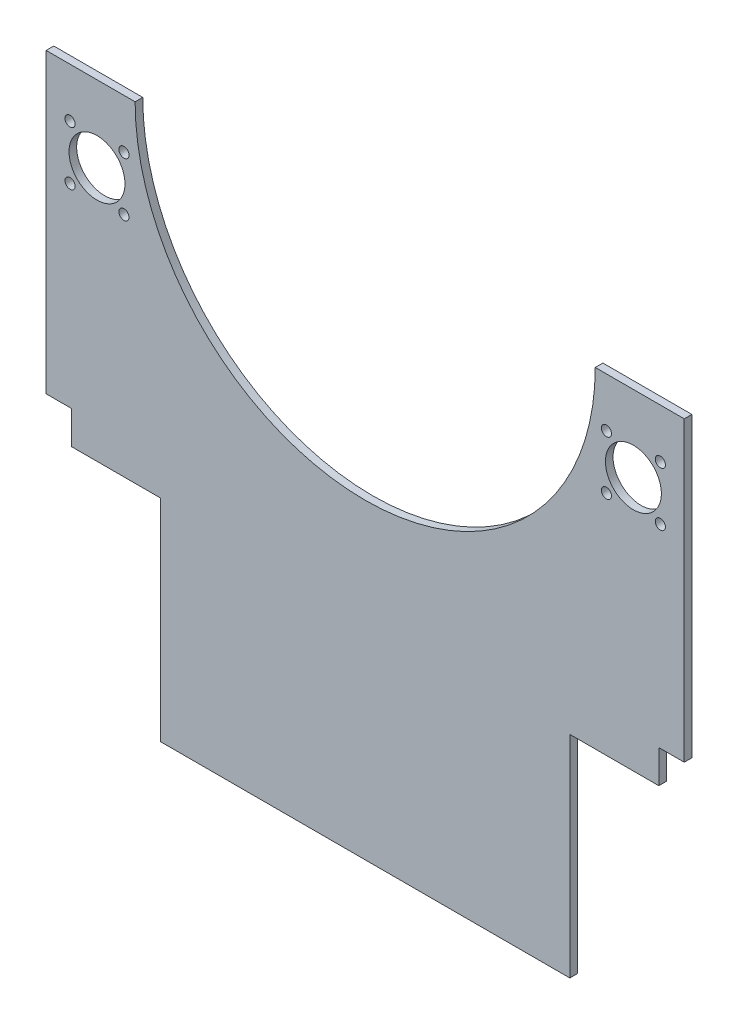
ISO-10303-21;
HEADER;
FILE_DESCRIPTION(('STEP AP214'),'2;1');
FILE_NAME('part.step','',(''),(''),'','','');
FILE_SCHEMA(('AUTOMOTIVE_DESIGN { 1 0 10303 214 1 1 1 1 }'));
ENDSEC;
DATA;
#1=APPLICATION_CONTEXT('core data for automotive mechanical design processes');
#2=APPLICATION_PROTOCOL_DEFINITION('international standard','automotive_design',2000,#1);
#3=PRODUCT_CONTEXT('',#1,'mechanical');
#4=PRODUCT('Part','Part','',(#3));
#5=PRODUCT_RELATED_PRODUCT_CATEGORY('part','',(#4));
#6=PRODUCT_DEFINITION_FORMATION('','',#4);
#7=PRODUCT_DEFINITION_CONTEXT('part definition',#1,'design');
#8=PRODUCT_DEFINITION('design','',#6,#7);
#9=PRODUCT_DEFINITION_SHAPE('','',#8);
#10=(LENGTH_UNIT() NAMED_UNIT(*) SI_UNIT(.MILLI.,.METRE.));
#11=(NAMED_UNIT(*) PLANE_ANGLE_UNIT() SI_UNIT($,.RADIAN.));
#12=(NAMED_UNIT(*) SI_UNIT($,.STERADIAN.) SOLID_ANGLE_UNIT());
#13=UNCERTAINTY_MEASURE_WITH_UNIT(LENGTH_MEASURE(1.E-05),#10,'distance_accuracy_value','');
#14=(GEOMETRIC_REPRESENTATION_CONTEXT(3) GLOBAL_UNCERTAINTY_ASSIGNED_CONTEXT((#13)) GLOBAL_UNIT_ASSIGNED_CONTEXT((#10,
#11,#12)) REPRESENTATION_CONTEXT('',''));
#15=CARTESIAN_POINT('',(0.,0.,0.));
#16=DIRECTION('',(0.,0.,1.));
#17=DIRECTION('',(1.,0.,0.));
#18=AXIS2_PLACEMENT_3D('',#15,#16,#17);
#19=CARTESIAN_POINT('',(0.,0.,3.));
#20=DIRECTION('',(0.,0.,1.));
#21=DIRECTION('',(1.,0.,0.));
#22=AXIS2_PLACEMENT_3D('',#19,#20,#21);
#23=PLANE('',#22);
#24=CARTESIAN_POINT('',(94.8933982822018,-19.3933982822018,3.));
#25=DIRECTION('',(0.,0.,1.));
#26=DIRECTION('',(1.,0.,0.));
#27=AXIS2_PLACEMENT_3D('',#24,#25,#26);
#28=CIRCLE('',#27,2.);
#29=CARTESIAN_POINT('',(96.8933982822018,-19.3933982822018,3.));
#30=VERTEX_POINT('',#29);
#31=EDGE_CURVE('E340',#30,#30,#28,.T.);
#32=ORIENTED_EDGE('',*,*,#31,.F.);
#33=EDGE_LOOP('',(#32));
#34=FACE_BOUND('',#33,.T.);
#35=CARTESIAN_POINT('',(-116.106601717798,-19.3933982822018,3.));
#36=DIRECTION('',(0.,0.,1.));
#37=DIRECTION('',(1.,0.,0.));
#38=AXIS2_PLACEMENT_3D('',#35,#36,#37);
#39=CIRCLE('',#38,2.);
#40=CARTESIAN_POINT('',(-114.106601717798,-19.3933982822018,3.));
#41=VERTEX_POINT('',#40);
#42=EDGE_CURVE('E352',#41,#41,#39,.T.);
#43=ORIENTED_EDGE('',*,*,#42,.F.);
#44=EDGE_LOOP('',(#43));
#45=FACE_BOUND('',#44,.T.);
#46=CARTESIAN_POINT('',(-94.8933982822018,-40.6066017177982,3.));
#47=DIRECTION('',(0.,0.,1.));
#48=DIRECTION('',(1.,0.,0.));
#49=AXIS2_PLACEMENT_3D('',#46,#47,#48);
#50=CIRCLE('',#49,2.);
#51=CARTESIAN_POINT('',(-92.8933982822018,-40.6066017177982,3.));
#52=VERTEX_POINT('',#51);
#53=EDGE_CURVE('E364',#52,#52,#50,.T.);
#54=ORIENTED_EDGE('',*,*,#53,.F.);
#55=EDGE_LOOP('',(#54));
#56=FACE_BOUND('',#55,.T.);
#57=CARTESIAN_POINT('',(-116.106601717798,-40.6066017177982,3.));
#58=DIRECTION('',(0.,0.,1.));
#59=DIRECTION('',(-1.,0.,0.));
#60=AXIS2_PLACEMENT_3D('',#57,#58,#59);
#61=CIRCLE('',#60,2.);
#62=CARTESIAN_POINT('',(-118.106601717798,-40.6066017177982,3.));
#63=VERTEX_POINT('',#62);
#64=EDGE_CURVE('E376',#63,#63,#61,.T.);
#65=ORIENTED_EDGE('',*,*,#64,.F.);
#66=EDGE_LOOP('',(#65));
#67=FACE_BOUND('',#66,.T.);
#68=CARTESIAN_POINT('',(-105.5,-30.,3.));
#69=DIRECTION('',(0.,0.,1.));
#70=DIRECTION('',(1.,0.,0.));
#71=AXIS2_PLACEMENT_3D('',#68,#69,#70);
#72=CIRCLE('',#71,11.);
#73=CARTESIAN_POINT('',(-94.5,-30.,3.));
#74=VERTEX_POINT('',#73);
#75=EDGE_CURVE('E168',#74,#74,#72,.T.);
#76=ORIENTED_EDGE('',*,*,#75,.F.);
#77=EDGE_LOOP('',(#76));
#78=FACE_BOUND('',#77,.T.);
#79=CARTESIAN_POINT('',(0.,0.,3.));
#80=DIRECTION('',(0.,0.,-1.));
#81=DIRECTION('',(1.,0.,0.));
#82=AXIS2_PLACEMENT_3D('',#79,#80,#81);
#83=CIRCLE('',#82,90.5);
#84=CARTESIAN_POINT('',(90.5,0.,3.));
#85=VERTEX_POINT('',#84);
#86=CARTESIAN_POINT('',(-90.5,0.,3.));
#87=VERTEX_POINT('',#86);
#88=EDGE_CURVE('E191',#85,#87,#83,.T.);
#89=ORIENTED_EDGE('',*,*,#88,.T.);
#90=DIRECTION('',(-1.,0.,0.));
#91=VECTOR('',#90,1.);
#92=CARTESIAN_POINT('',(-90.5,0.,3.));
#93=LINE('',#92,#91);
#94=CARTESIAN_POINT('',(-125.5,0.,3.));
#95=VERTEX_POINT('',#94);
#96=EDGE_CURVE('E109',#87,#95,#93,.T.);
#97=ORIENTED_EDGE('',*,*,#96,.T.);
#98=DIRECTION('',(0.,-1.,0.));
#99=VECTOR('',#98,1.);
#100=CARTESIAN_POINT('',(-125.5,0.,3.));
#101=LINE('',#100,#99);
#102=CARTESIAN_POINT('',(-125.5,-117.,3.));
#103=VERTEX_POINT('',#102);
#104=EDGE_CURVE('E224',#95,#103,#101,.T.);
#105=ORIENTED_EDGE('',*,*,#104,.T.);
#106=DIRECTION('',(1.,0.,0.));
#107=VECTOR('',#106,1.);
#108=CARTESIAN_POINT('',(-125.5,-117.,3.));
#109=LINE('',#108,#107);
#110=CARTESIAN_POINT('',(-115.5,-117.,3.));
#111=VERTEX_POINT('',#110);
#112=EDGE_CURVE('E243',#103,#111,#109,.T.);
#113=ORIENTED_EDGE('',*,*,#112,.T.);
#114=DIRECTION('',(0.,-1.,0.));
#115=VECTOR('',#114,1.);
#116=CARTESIAN_POINT('',(-115.5,-117.,3.));
#117=LINE('',#116,#115);
#118=CARTESIAN_POINT('',(-115.5,-130.,3.));
#119=VERTEX_POINT('',#118);
#120=EDGE_CURVE('E240',#111,#119,#117,.T.);
#121=ORIENTED_EDGE('',*,*,#120,.T.);
#122=DIRECTION('',(1.,0.,0.));
#123=VECTOR('',#122,1.);
#124=CARTESIAN_POINT('',(-115.5,-130.,3.));
#125=LINE('',#124,#123);
#126=CARTESIAN_POINT('',(-80.4999999999997,-130.,3.));
#127=VERTEX_POINT('',#126);
#128=EDGE_CURVE('E242',#119,#127,#125,.T.);
#129=ORIENTED_EDGE('',*,*,#128,.T.);
#130=DIRECTION('',(0.,-1.,0.));
#131=VECTOR('',#130,1.);
#132=CARTESIAN_POINT('',(-80.4999999999997,-130.,3.));
#133=LINE('',#132,#131);
#134=CARTESIAN_POINT('',(-80.4999999999997,-213.,3.));
#135=VERTEX_POINT('',#134);
#136=EDGE_CURVE('E245',#127,#135,#133,.T.);
#137=ORIENTED_EDGE('',*,*,#136,.T.);
#138=DIRECTION('',(1.,0.,0.));
#139=VECTOR('',#138,1.);
#140=CARTESIAN_POINT('',(-80.4999999999997,-213.,3.));
#141=LINE('',#140,#139);
#142=CARTESIAN_POINT('',(80.4999999999997,-213.,3.));
#143=VERTEX_POINT('',#142);
#144=EDGE_CURVE('E251',#135,#143,#141,.T.);
#145=ORIENTED_EDGE('',*,*,#144,.T.);
#146=DIRECTION('',(0.,1.,0.));
#147=VECTOR('',#146,1.);
#148=CARTESIAN_POINT('',(80.4999999999997,-130.,3.));
#149=LINE('',#148,#147);
#150=CARTESIAN_POINT('',(80.4999999999997,-130.,3.));
#151=VERTEX_POINT('',#150);
#152=EDGE_CURVE('E253',#143,#151,#149,.T.);
#153=ORIENTED_EDGE('',*,*,#152,.T.);
#154=DIRECTION('',(1.,0.,0.));
#155=VECTOR('',#154,1.);
#156=CARTESIAN_POINT('',(115.5,-130.,3.));
#157=LINE('',#156,#155);
#158=CARTESIAN_POINT('',(115.5,-130.,3.));
#159=VERTEX_POINT('',#158);
#160=EDGE_CURVE('E255',#151,#159,#157,.T.);
#161=ORIENTED_EDGE('',*,*,#160,.T.);
#162=DIRECTION('',(0.,1.,0.));
#163=VECTOR('',#162,1.);
#164=CARTESIAN_POINT('',(115.5,-117.,3.));
#165=LINE('',#164,#163);
#166=CARTESIAN_POINT('',(115.5,-117.,3.));
#167=VERTEX_POINT('',#166);
#168=EDGE_CURVE('E146',#159,#167,#165,.T.);
#169=ORIENTED_EDGE('',*,*,#168,.T.);
#170=DIRECTION('',(1.,0.,0.));
#171=VECTOR('',#170,1.);
#172=CARTESIAN_POINT('',(125.5,-117.,3.));
#173=LINE('',#172,#171);
#174=CARTESIAN_POINT('',(125.5,-117.,3.));
#175=VERTEX_POINT('',#174);
#176=EDGE_CURVE('E140',#167,#175,#173,.T.);
#177=ORIENTED_EDGE('',*,*,#176,.T.);
#178=DIRECTION('',(0.,1.,0.));
#179=VECTOR('',#178,1.);
#180=CARTESIAN_POINT('',(125.5,0.,3.));
#181=LINE('',#180,#179);
#182=CARTESIAN_POINT('',(125.5,0.,3.));
#183=VERTEX_POINT('',#182);
#184=EDGE_CURVE('E144',#175,#183,#181,.T.);
#185=ORIENTED_EDGE('',*,*,#184,.T.);
#186=DIRECTION('',(-1.,0.,0.));
#187=VECTOR('',#186,1.);
#188=CARTESIAN_POINT('',(90.5,0.,3.));
#189=LINE('',#188,#187);
#190=EDGE_CURVE('E48',#183,#85,#189,.T.);
#191=ORIENTED_EDGE('',*,*,#190,.T.);
#192=EDGE_LOOP('',(#89,#97,#105,#113,#121,#129,#137,#145,#153,#161,#169,#177,#185,#191));
#193=FACE_BOUND('',#192,.T.);
#194=CARTESIAN_POINT('',(-94.8933982822018,-19.3933982822018,3.));
#195=DIRECTION('',(0.,0.,1.));
#196=DIRECTION('',(-1.,0.,0.));
#197=AXIS2_PLACEMENT_3D('',#194,#195,#196);
#198=CIRCLE('',#197,2.);
#199=CARTESIAN_POINT('',(-96.8933982822018,-19.3933982822018,3.));
#200=VERTEX_POINT('',#199);
#201=EDGE_CURVE('E382',#200,#200,#198,.T.);
#202=ORIENTED_EDGE('',*,*,#201,.F.);
#203=EDGE_LOOP('',(#202));
#204=FACE_BOUND('',#203,.T.);
#205=CARTESIAN_POINT('',(116.106601717798,-19.3933982822018,3.));
#206=DIRECTION('',(0.,0.,1.));
#207=DIRECTION('',(-1.,0.,0.));
#208=AXIS2_PLACEMENT_3D('',#205,#206,#207);
#209=CIRCLE('',#208,2.);
#210=CARTESIAN_POINT('',(114.106601717798,-19.3933982822018,3.));
#211=VERTEX_POINT('',#210);
#212=EDGE_CURVE('E370',#211,#211,#209,.T.);
#213=ORIENTED_EDGE('',*,*,#212,.F.);
#214=EDGE_LOOP('',(#213));
#215=FACE_BOUND('',#214,.T.);
#216=CARTESIAN_POINT('',(94.8933982822018,-40.6066017177982,3.));
#217=DIRECTION('',(0.,0.,1.));
#218=DIRECTION('',(-1.,0.,0.));
#219=AXIS2_PLACEMENT_3D('',#216,#217,#218);
#220=CIRCLE('',#219,2.);
#221=CARTESIAN_POINT('',(92.8933982822018,-40.6066017177982,3.));
#222=VERTEX_POINT('',#221);
#223=EDGE_CURVE('E358',#222,#222,#220,.T.);
#224=ORIENTED_EDGE('',*,*,#223,.F.);
#225=EDGE_LOOP('',(#224));
#226=FACE_BOUND('',#225,.T.);
#227=CARTESIAN_POINT('',(116.106601717798,-40.6066017177982,3.));
#228=DIRECTION('',(0.,0.,1.));
#229=DIRECTION('',(1.,0.,0.));
#230=AXIS2_PLACEMENT_3D('',#227,#228,#229);
#231=CIRCLE('',#230,2.);
#232=CARTESIAN_POINT('',(118.106601717798,-40.6066017177982,3.));
#233=VERTEX_POINT('',#232);
#234=EDGE_CURVE('E346',#233,#233,#231,.T.);
#235=ORIENTED_EDGE('',*,*,#234,.F.);
#236=EDGE_LOOP('',(#235));
#237=FACE_BOUND('',#236,.T.);
#238=CARTESIAN_POINT('',(105.5,-30.,3.));
#239=DIRECTION('',(0.,0.,1.));
#240=DIRECTION('',(-1.,0.,0.));
#241=AXIS2_PLACEMENT_3D('',#238,#239,#240);
#242=CIRCLE('',#241,11.);
#243=CARTESIAN_POINT('',(94.5,-30.,3.));
#244=VERTEX_POINT('',#243);
#245=EDGE_CURVE('E331',#244,#244,#242,.T.);
#246=ORIENTED_EDGE('',*,*,#245,.F.);
#247=EDGE_LOOP('',(#246));
#248=FACE_BOUND('',#247,.T.);
#249=ADVANCED_FACE('F31',(#34,#45,#56,#67,#78,#193,#204,#215,#226,#237,#248),#23,.T.);
#250=CARTESIAN_POINT('',(0.,0.,0.));
#251=DIRECTION('',(0.,0.,1.));
#252=DIRECTION('',(1.,0.,0.));
#253=AXIS2_PLACEMENT_3D('',#250,#251,#252);
#254=PLANE('',#253);
#255=CARTESIAN_POINT('',(94.8933982822018,-19.3933982822018,0.));
#256=DIRECTION('',(0.,0.,1.));
#257=DIRECTION('',(1.,0.,0.));
#258=AXIS2_PLACEMENT_3D('',#255,#256,#257);
#259=CIRCLE('',#258,2.);
#260=CARTESIAN_POINT('',(96.8933982822018,-19.3933982822018,0.));
#261=VERTEX_POINT('',#260);
#262=EDGE_CURVE('E337',#261,#261,#259,.T.);
#263=ORIENTED_EDGE('',*,*,#262,.T.);
#264=EDGE_LOOP('',(#263));
#265=FACE_BOUND('',#264,.T.);
#266=CARTESIAN_POINT('',(-116.106601717798,-19.3933982822018,0.));
#267=DIRECTION('',(0.,0.,1.));
#268=DIRECTION('',(1.,0.,0.));
#269=AXIS2_PLACEMENT_3D('',#266,#267,#268);
#270=CIRCLE('',#269,2.);
#271=CARTESIAN_POINT('',(-114.106601717798,-19.3933982822018,0.));
#272=VERTEX_POINT('',#271);
#273=EDGE_CURVE('E349',#272,#272,#270,.T.);
#274=ORIENTED_EDGE('',*,*,#273,.T.);
#275=EDGE_LOOP('',(#274));
#276=FACE_BOUND('',#275,.T.);
#277=CARTESIAN_POINT('',(-94.8933982822018,-40.6066017177982,0.));
#278=DIRECTION('',(0.,0.,1.));
#279=DIRECTION('',(1.,0.,0.));
#280=AXIS2_PLACEMENT_3D('',#277,#278,#279);
#281=CIRCLE('',#280,2.);
#282=CARTESIAN_POINT('',(-92.8933982822018,-40.6066017177982,0.));
#283=VERTEX_POINT('',#282);
#284=EDGE_CURVE('E361',#283,#283,#281,.T.);
#285=ORIENTED_EDGE('',*,*,#284,.T.);
#286=EDGE_LOOP('',(#285));
#287=FACE_BOUND('',#286,.T.);
#288=CARTESIAN_POINT('',(-116.106601717798,-40.6066017177982,0.));
#289=DIRECTION('',(0.,0.,1.));
#290=DIRECTION('',(-1.,0.,0.));
#291=AXIS2_PLACEMENT_3D('',#288,#289,#290);
#292=CIRCLE('',#291,2.);
#293=CARTESIAN_POINT('',(-118.106601717798,-40.6066017177982,0.));
#294=VERTEX_POINT('',#293);
#295=EDGE_CURVE('E373',#294,#294,#292,.T.);
#296=ORIENTED_EDGE('',*,*,#295,.T.);
#297=EDGE_LOOP('',(#296));
#298=FACE_BOUND('',#297,.T.);
#299=CARTESIAN_POINT('',(-105.5,-30.,0.));
#300=DIRECTION('',(0.,0.,1.));
#301=DIRECTION('',(1.,0.,0.));
#302=AXIS2_PLACEMENT_3D('',#299,#300,#301);
#303=CIRCLE('',#302,11.);
#304=CARTESIAN_POINT('',(-94.5,-30.,0.));
#305=VERTEX_POINT('',#304);
#306=EDGE_CURVE('E385',#305,#305,#303,.T.);
#307=ORIENTED_EDGE('',*,*,#306,.T.);
#308=EDGE_LOOP('',(#307));
#309=FACE_BOUND('',#308,.T.);
#310=CARTESIAN_POINT('',(0.,0.,0.));
#311=DIRECTION('',(0.,0.,-1.));
#312=DIRECTION('',(1.,0.,0.));
#313=AXIS2_PLACEMENT_3D('',#310,#311,#312);
#314=CIRCLE('',#313,90.5);
#315=CARTESIAN_POINT('',(90.5,0.,0.));
#316=VERTEX_POINT('',#315);
#317=CARTESIAN_POINT('',(-90.5,0.,0.));
#318=VERTEX_POINT('',#317);
#319=EDGE_CURVE('E164',#316,#318,#314,.T.);
#320=ORIENTED_EDGE('',*,*,#319,.F.);
#321=DIRECTION('',(-1.,0.,0.));
#322=VECTOR('',#321,1.);
#323=CARTESIAN_POINT('',(90.5,0.,0.));
#324=LINE('',#323,#322);
#325=CARTESIAN_POINT('',(125.5,0.,0.));
#326=VERTEX_POINT('',#325);
#327=EDGE_CURVE('E101',#326,#316,#324,.T.);
#328=ORIENTED_EDGE('',*,*,#327,.F.);
#329=DIRECTION('',(0.,1.,0.));
#330=VECTOR('',#329,1.);
#331=CARTESIAN_POINT('',(125.5,0.,0.));
#332=LINE('',#331,#330);
#333=CARTESIAN_POINT('',(125.5,-117.,0.));
#334=VERTEX_POINT('',#333);
#335=EDGE_CURVE('E95',#334,#326,#332,.T.);
#336=ORIENTED_EDGE('',*,*,#335,.F.);
#337=DIRECTION('',(1.,0.,0.));
#338=VECTOR('',#337,1.);
#339=CARTESIAN_POINT('',(125.5,-117.,0.));
#340=LINE('',#339,#338);
#341=CARTESIAN_POINT('',(115.5,-117.,0.));
#342=VERTEX_POINT('',#341);
#343=EDGE_CURVE('E154',#342,#334,#340,.T.);
#344=ORIENTED_EDGE('',*,*,#343,.F.);
#345=DIRECTION('',(0.,1.,0.));
#346=VECTOR('',#345,1.);
#347=CARTESIAN_POINT('',(115.5,-117.,0.));
#348=LINE('',#347,#346);
#349=CARTESIAN_POINT('',(115.5,-130.,0.));
#350=VERTEX_POINT('',#349);
#351=EDGE_CURVE('E186',#350,#342,#348,.T.);
#352=ORIENTED_EDGE('',*,*,#351,.F.);
#353=DIRECTION('',(1.,0.,0.));
#354=VECTOR('',#353,1.);
#355=CARTESIAN_POINT('',(115.5,-130.,0.));
#356=LINE('',#355,#354);
#357=CARTESIAN_POINT('',(80.4999999999997,-130.,0.));
#358=VERTEX_POINT('',#357);
#359=EDGE_CURVE('E184',#358,#350,#356,.T.);
#360=ORIENTED_EDGE('',*,*,#359,.F.);
#361=DIRECTION('',(0.,1.,0.));
#362=VECTOR('',#361,1.);
#363=CARTESIAN_POINT('',(80.4999999999997,-130.,0.));
#364=LINE('',#363,#362);
#365=CARTESIAN_POINT('',(80.4999999999997,-213.,0.));
#366=VERTEX_POINT('',#365);
#367=EDGE_CURVE('E182',#366,#358,#364,.T.);
#368=ORIENTED_EDGE('',*,*,#367,.F.);
#369=DIRECTION('',(1.,0.,0.));
#370=VECTOR('',#369,1.);
#371=CARTESIAN_POINT('',(-80.4999999999997,-213.,0.));
#372=LINE('',#371,#370);
#373=CARTESIAN_POINT('',(-80.4999999999997,-213.,0.));
#374=VERTEX_POINT('',#373);
#375=EDGE_CURVE('E180',#374,#366,#372,.T.);
#376=ORIENTED_EDGE('',*,*,#375,.F.);
#377=DIRECTION('',(0.,-1.,0.));
#378=VECTOR('',#377,1.);
#379=CARTESIAN_POINT('',(-80.4999999999997,-130.,0.));
#380=LINE('',#379,#378);
#381=CARTESIAN_POINT('',(-80.4999999999997,-130.,0.));
#382=VERTEX_POINT('',#381);
#383=EDGE_CURVE('E178',#382,#374,#380,.T.);
#384=ORIENTED_EDGE('',*,*,#383,.F.);
#385=DIRECTION('',(1.,0.,0.));
#386=VECTOR('',#385,1.);
#387=CARTESIAN_POINT('',(-115.5,-130.,0.));
#388=LINE('',#387,#386);
#389=CARTESIAN_POINT('',(-115.5,-130.,0.));
#390=VERTEX_POINT('',#389);
#391=EDGE_CURVE('E176',#390,#382,#388,.T.);
#392=ORIENTED_EDGE('',*,*,#391,.F.);
#393=DIRECTION('',(0.,-1.,0.));
#394=VECTOR('',#393,1.);
#395=CARTESIAN_POINT('',(-115.5,-117.,0.));
#396=LINE('',#395,#394);
#397=CARTESIAN_POINT('',(-115.5,-117.,0.));
#398=VERTEX_POINT('',#397);
#399=EDGE_CURVE('E174',#398,#390,#396,.T.);
#400=ORIENTED_EDGE('',*,*,#399,.F.);
#401=DIRECTION('',(1.,0.,0.));
#402=VECTOR('',#401,1.);
#403=CARTESIAN_POINT('',(-125.5,-117.,0.));
#404=LINE('',#403,#402);
#405=CARTESIAN_POINT('',(-125.5,-117.,0.));
#406=VERTEX_POINT('',#405);
#407=EDGE_CURVE('E172',#406,#398,#404,.T.);
#408=ORIENTED_EDGE('',*,*,#407,.F.);
#409=DIRECTION('',(0.,-1.,0.));
#410=VECTOR('',#409,1.);
#411=CARTESIAN_POINT('',(-125.5,0.,0.));
#412=LINE('',#411,#410);
#413=CARTESIAN_POINT('',(-125.5,0.,0.));
#414=VERTEX_POINT('',#413);
#415=EDGE_CURVE('E170',#414,#406,#412,.T.);
#416=ORIENTED_EDGE('',*,*,#415,.F.);
#417=DIRECTION('',(-1.,0.,0.));
#418=VECTOR('',#417,1.);
#419=CARTESIAN_POINT('',(-90.5,0.,0.));
#420=LINE('',#419,#418);
#421=EDGE_CURVE('E167',#318,#414,#420,.T.);
#422=ORIENTED_EDGE('',*,*,#421,.F.);
#423=EDGE_LOOP('',(#320,#328,#336,#344,#352,#360,#368,#376,#384,#392,#400,#408,#416,#422));
#424=FACE_BOUND('',#423,.T.);
#425=CARTESIAN_POINT('',(-94.8933982822018,-19.3933982822018,0.));
#426=DIRECTION('',(0.,0.,1.));
#427=DIRECTION('',(-1.,0.,0.));
#428=AXIS2_PLACEMENT_3D('',#425,#426,#427);
#429=CIRCLE('',#428,2.);
#430=CARTESIAN_POINT('',(-96.8933982822018,-19.3933982822018,0.));
#431=VERTEX_POINT('',#430);
#432=EDGE_CURVE('E379',#431,#431,#429,.T.);
#433=ORIENTED_EDGE('',*,*,#432,.T.);
#434=EDGE_LOOP('',(#433));
#435=FACE_BOUND('',#434,.T.);
#436=CARTESIAN_POINT('',(116.106601717798,-19.3933982822018,0.));
#437=DIRECTION('',(0.,0.,1.));
#438=DIRECTION('',(-1.,0.,0.));
#439=AXIS2_PLACEMENT_3D('',#436,#437,#438);
#440=CIRCLE('',#439,2.);
#441=CARTESIAN_POINT('',(114.106601717798,-19.3933982822018,0.));
#442=VERTEX_POINT('',#441);
#443=EDGE_CURVE('E367',#442,#442,#440,.T.);
#444=ORIENTED_EDGE('',*,*,#443,.T.);
#445=EDGE_LOOP('',(#444));
#446=FACE_BOUND('',#445,.T.);
#447=CARTESIAN_POINT('',(94.8933982822018,-40.6066017177982,0.));
#448=DIRECTION('',(0.,0.,1.));
#449=DIRECTION('',(-1.,0.,0.));
#450=AXIS2_PLACEMENT_3D('',#447,#448,#449);
#451=CIRCLE('',#450,2.);
#452=CARTESIAN_POINT('',(92.8933982822018,-40.6066017177982,0.));
#453=VERTEX_POINT('',#452);
#454=EDGE_CURVE('E355',#453,#453,#451,.T.);
#455=ORIENTED_EDGE('',*,*,#454,.T.);
#456=EDGE_LOOP('',(#455));
#457=FACE_BOUND('',#456,.T.);
#458=CARTESIAN_POINT('',(116.106601717798,-40.6066017177982,0.));
#459=DIRECTION('',(0.,0.,1.));
#460=DIRECTION('',(1.,0.,0.));
#461=AXIS2_PLACEMENT_3D('',#458,#459,#460);
#462=CIRCLE('',#461,2.);
#463=CARTESIAN_POINT('',(118.106601717798,-40.6066017177982,0.));
#464=VERTEX_POINT('',#463);
#465=EDGE_CURVE('E343',#464,#464,#462,.T.);
#466=ORIENTED_EDGE('',*,*,#465,.T.);
#467=EDGE_LOOP('',(#466));
#468=FACE_BOUND('',#467,.T.);
#469=CARTESIAN_POINT('',(105.5,-30.,0.));
#470=DIRECTION('',(0.,0.,1.));
#471=DIRECTION('',(-1.,0.,0.));
#472=AXIS2_PLACEMENT_3D('',#469,#470,#471);
#473=CIRCLE('',#472,11.);
#474=CARTESIAN_POINT('',(94.5,-30.,0.));
#475=VERTEX_POINT('',#474);
#476=EDGE_CURVE('E334',#475,#475,#473,.T.);
#477=ORIENTED_EDGE('',*,*,#476,.T.);
#478=EDGE_LOOP('',(#477));
#479=FACE_BOUND('',#478,.T.);
#480=ADVANCED_FACE('F228',(#265,#276,#287,#298,#309,#424,#435,#446,#457,#468,#479),#254,.F.);
#481=CARTESIAN_POINT('',(0.,0.,3.));
#482=DIRECTION('',(0.,0.,-1.));
#483=DIRECTION('',(-1.,0.,0.));
#484=AXIS2_PLACEMENT_3D('',#481,#482,#483);
#485=CYLINDRICAL_SURFACE('',#484,90.5);
#486=ORIENTED_EDGE('',*,*,#319,.T.);
#487=DIRECTION('',(0.,0.,-1.));
#488=VECTOR('',#487,1.);
#489=CARTESIAN_POINT('',(-90.5,0.,3.));
#490=LINE('',#489,#488);
#491=EDGE_CURVE('E11',#87,#318,#490,.T.);
#492=ORIENTED_EDGE('',*,*,#491,.F.);
#493=ORIENTED_EDGE('',*,*,#88,.F.);
#494=DIRECTION('',(0.,0.,-1.));
#495=VECTOR('',#494,1.);
#496=CARTESIAN_POINT('',(90.5,0.,3.));
#497=LINE('',#496,#495);
#498=EDGE_CURVE('E160',#85,#316,#497,.T.);
#499=ORIENTED_EDGE('',*,*,#498,.T.);
#500=EDGE_LOOP('',(#486,#492,#493,#499));
#501=FACE_BOUND('',#500,.T.);
#502=ADVANCED_FACE('F33',(#501),#485,.F.);
#503=CARTESIAN_POINT('',(-90.5,0.,3.));
#504=DIRECTION('',(0.,-1.,0.));
#505=DIRECTION('',(1.,0.,0.));
#506=AXIS2_PLACEMENT_3D('',#503,#504,#505);
#507=PLANE('',#506);
#508=ORIENTED_EDGE('',*,*,#421,.T.);
#509=DIRECTION('',(0.,0.,-1.));
#510=VECTOR('',#509,1.);
#511=CARTESIAN_POINT('',(-125.5,0.,3.));
#512=LINE('',#511,#510);
#513=EDGE_CURVE('E40',#95,#414,#512,.T.);
#514=ORIENTED_EDGE('',*,*,#513,.F.);
#515=ORIENTED_EDGE('',*,*,#96,.F.);
#516=ORIENTED_EDGE('',*,*,#491,.T.);
#517=EDGE_LOOP('',(#508,#514,#515,#516));
#518=FACE_BOUND('',#517,.T.);
#519=ADVANCED_FACE('F568',(#518),#507,.F.);
#520=CARTESIAN_POINT('',(-125.5,0.,3.));
#521=DIRECTION('',(1.,0.,0.));
#522=DIRECTION('',(0.,0.,-1.));
#523=AXIS2_PLACEMENT_3D('',#520,#521,#522);
#524=PLANE('',#523);
#525=ORIENTED_EDGE('',*,*,#415,.T.);
#526=DIRECTION('',(0.,0.,-1.));
#527=VECTOR('',#526,1.);
#528=CARTESIAN_POINT('',(-125.5,-117.,3.));
#529=LINE('',#528,#527);
#530=EDGE_CURVE('E216',#103,#406,#529,.T.);
#531=ORIENTED_EDGE('',*,*,#530,.F.);
#532=ORIENTED_EDGE('',*,*,#104,.F.);
#533=ORIENTED_EDGE('',*,*,#513,.T.);
#534=EDGE_LOOP('',(#525,#531,#532,#533));
#535=FACE_BOUND('',#534,.T.);
#536=ADVANCED_FACE('F222',(#535),#524,.F.);
#537=CARTESIAN_POINT('',(-125.5,-117.,3.));
#538=DIRECTION('',(0.,1.,0.));
#539=DIRECTION('',(0.,0.,1.));
#540=AXIS2_PLACEMENT_3D('',#537,#538,#539);
#541=PLANE('',#540);
#542=ORIENTED_EDGE('',*,*,#407,.T.);
#543=DIRECTION('',(0.,0.,-1.));
#544=VECTOR('',#543,1.);
#545=CARTESIAN_POINT('',(-115.5,-117.,3.));
#546=LINE('',#545,#544);
#547=EDGE_CURVE('E213',#111,#398,#546,.T.);
#548=ORIENTED_EDGE('',*,*,#547,.F.);
#549=ORIENTED_EDGE('',*,*,#112,.F.);
#550=ORIENTED_EDGE('',*,*,#530,.T.);
#551=EDGE_LOOP('',(#542,#548,#549,#550));
#552=FACE_BOUND('',#551,.T.);
#553=ADVANCED_FACE('F234',(#552),#541,.F.);
#554=CARTESIAN_POINT('',(-115.5,-117.,3.));
#555=DIRECTION('',(1.,0.,0.));
#556=DIRECTION('',(0.,0.,-1.));
#557=AXIS2_PLACEMENT_3D('',#554,#555,#556);
#558=PLANE('',#557);
#559=ORIENTED_EDGE('',*,*,#399,.T.);
#560=DIRECTION('',(0.,0.,-1.));
#561=VECTOR('',#560,1.);
#562=CARTESIAN_POINT('',(-115.5,-130.,3.));
#563=LINE('',#562,#561);
#564=EDGE_CURVE('E210',#119,#390,#563,.T.);
#565=ORIENTED_EDGE('',*,*,#564,.F.);
#566=ORIENTED_EDGE('',*,*,#120,.F.);
#567=ORIENTED_EDGE('',*,*,#547,.T.);
#568=EDGE_LOOP('',(#559,#565,#566,#567));
#569=FACE_BOUND('',#568,.T.);
#570=ADVANCED_FACE('F238',(#569),#558,.F.);
#571=CARTESIAN_POINT('',(-115.5,-130.,3.));
#572=DIRECTION('',(0.,1.,0.));
#573=DIRECTION('',(0.,0.,1.));
#574=AXIS2_PLACEMENT_3D('',#571,#572,#573);
#575=PLANE('',#574);
#576=ORIENTED_EDGE('',*,*,#391,.T.);
#577=DIRECTION('',(0.,0.,-1.));
#578=VECTOR('',#577,1.);
#579=CARTESIAN_POINT('',(-80.4999999999997,-130.,3.));
#580=LINE('',#579,#578);
#581=EDGE_CURVE('E207',#127,#382,#580,.T.);
#582=ORIENTED_EDGE('',*,*,#581,.F.);
#583=ORIENTED_EDGE('',*,*,#128,.F.);
#584=ORIENTED_EDGE('',*,*,#564,.T.);
#585=EDGE_LOOP('',(#576,#582,#583,#584));
#586=FACE_BOUND('',#585,.T.);
#587=ADVANCED_FACE('F533',(#586),#575,.F.);
#588=CARTESIAN_POINT('',(-80.4999999999997,-130.,3.));
#589=DIRECTION('',(1.,0.,0.));
#590=DIRECTION('',(0.,0.,-1.));
#591=AXIS2_PLACEMENT_3D('',#588,#589,#590);
#592=PLANE('',#591);
#593=ORIENTED_EDGE('',*,*,#383,.T.);
#594=DIRECTION('',(0.,0.,-1.));
#595=VECTOR('',#594,1.);
#596=CARTESIAN_POINT('',(-80.4999999999997,-213.,3.));
#597=LINE('',#596,#595);
#598=EDGE_CURVE('E204',#135,#374,#597,.T.);
#599=ORIENTED_EDGE('',*,*,#598,.F.);
#600=ORIENTED_EDGE('',*,*,#136,.F.);
#601=ORIENTED_EDGE('',*,*,#581,.T.);
#602=EDGE_LOOP('',(#593,#599,#600,#601));
#603=FACE_BOUND('',#602,.T.);
#604=ADVANCED_FACE('F523',(#603),#592,.F.);
#605=CARTESIAN_POINT('',(-80.4999999999997,-213.,3.));
#606=DIRECTION('',(0.,1.,0.));
#607=DIRECTION('',(-1.,0.,0.));
#608=AXIS2_PLACEMENT_3D('',#605,#606,#607);
#609=PLANE('',#608);
#610=ORIENTED_EDGE('',*,*,#375,.T.);
#611=DIRECTION('',(0.,0.,-1.));
#612=VECTOR('',#611,1.);
#613=CARTESIAN_POINT('',(80.4999999999997,-213.,3.));
#614=LINE('',#613,#612);
#615=EDGE_CURVE('E201',#143,#366,#614,.T.);
#616=ORIENTED_EDGE('',*,*,#615,.F.);
#617=ORIENTED_EDGE('',*,*,#144,.F.);
#618=ORIENTED_EDGE('',*,*,#598,.T.);
#619=EDGE_LOOP('',(#610,#616,#617,#618));
#620=FACE_BOUND('',#619,.T.);
#621=ADVANCED_FACE('F513',(#620),#609,.F.);
#622=CARTESIAN_POINT('',(80.4999999999997,-130.,3.));
#623=DIRECTION('',(-1.,0.,0.));
#624=DIRECTION('',(0.,-1.,0.));
#625=AXIS2_PLACEMENT_3D('',#622,#623,#624);
#626=PLANE('',#625);
#627=ORIENTED_EDGE('',*,*,#367,.T.);
#628=DIRECTION('',(0.,0.,-1.));
#629=VECTOR('',#628,1.);
#630=CARTESIAN_POINT('',(80.4999999999997,-130.,3.));
#631=LINE('',#630,#629);
#632=EDGE_CURVE('E198',#151,#358,#631,.T.);
#633=ORIENTED_EDGE('',*,*,#632,.F.);
#634=ORIENTED_EDGE('',*,*,#152,.F.);
#635=ORIENTED_EDGE('',*,*,#615,.T.);
#636=EDGE_LOOP('',(#627,#633,#634,#635));
#637=FACE_BOUND('',#636,.T.);
#638=ADVANCED_FACE('F504',(#637),#626,.F.);
#639=CARTESIAN_POINT('',(115.5,-130.,3.));
#640=DIRECTION('',(0.,1.,0.));
#641=DIRECTION('',(0.,0.,1.));
#642=AXIS2_PLACEMENT_3D('',#639,#640,#641);
#643=PLANE('',#642);
#644=ORIENTED_EDGE('',*,*,#359,.T.);
#645=DIRECTION('',(0.,0.,-1.));
#646=VECTOR('',#645,1.);
#647=CARTESIAN_POINT('',(115.5,-130.,3.));
#648=LINE('',#647,#646);
#649=EDGE_CURVE('E195',#159,#350,#648,.T.);
#650=ORIENTED_EDGE('',*,*,#649,.F.);
#651=ORIENTED_EDGE('',*,*,#160,.F.);
#652=ORIENTED_EDGE('',*,*,#632,.T.);
#653=EDGE_LOOP('',(#644,#650,#651,#652));
#654=FACE_BOUND('',#653,.T.);
#655=ADVANCED_FACE('F261',(#654),#643,.F.);
#656=CARTESIAN_POINT('',(115.5,-117.,3.));
#657=DIRECTION('',(-1.,0.,0.));
#658=DIRECTION('',(0.,0.,1.));
#659=AXIS2_PLACEMENT_3D('',#656,#657,#658);
#660=PLANE('',#659);
#661=ORIENTED_EDGE('',*,*,#351,.T.);
#662=DIRECTION('',(0.,0.,-1.));
#663=VECTOR('',#662,1.);
#664=CARTESIAN_POINT('',(115.5,-117.,3.));
#665=LINE('',#664,#663);
#666=EDGE_CURVE('E155',#167,#342,#665,.T.);
#667=ORIENTED_EDGE('',*,*,#666,.F.);
#668=ORIENTED_EDGE('',*,*,#168,.F.);
#669=ORIENTED_EDGE('',*,*,#649,.T.);
#670=EDGE_LOOP('',(#661,#667,#668,#669));
#671=FACE_BOUND('',#670,.T.);
#672=ADVANCED_FACE('F265',(#671),#660,.F.);
#673=CARTESIAN_POINT('',(125.5,-117.,3.));
#674=DIRECTION('',(0.,1.,0.));
#675=DIRECTION('',(0.,0.,1.));
#676=AXIS2_PLACEMENT_3D('',#673,#674,#675);
#677=PLANE('',#676);
#678=ORIENTED_EDGE('',*,*,#343,.T.);
#679=DIRECTION('',(0.,0.,-1.));
#680=VECTOR('',#679,1.);
#681=CARTESIAN_POINT('',(125.5,-117.,3.));
#682=LINE('',#681,#680);
#683=EDGE_CURVE('E151',#175,#334,#682,.T.);
#684=ORIENTED_EDGE('',*,*,#683,.F.);
#685=ORIENTED_EDGE('',*,*,#176,.F.);
#686=ORIENTED_EDGE('',*,*,#666,.T.);
#687=EDGE_LOOP('',(#678,#684,#685,#686));
#688=FACE_BOUND('',#687,.T.);
#689=ADVANCED_FACE('F152',(#688),#677,.F.);
#690=CARTESIAN_POINT('',(125.5,0.,3.));
#691=DIRECTION('',(-1.,0.,0.));
#692=DIRECTION('',(0.,0.,1.));
#693=AXIS2_PLACEMENT_3D('',#690,#691,#692);
#694=PLANE('',#693);
#695=ORIENTED_EDGE('',*,*,#335,.T.);
#696=DIRECTION('',(0.,0.,-1.));
#697=VECTOR('',#696,1.);
#698=CARTESIAN_POINT('',(125.5,0.,3.));
#699=LINE('',#698,#697);
#700=EDGE_CURVE('E156',#183,#326,#699,.T.);
#701=ORIENTED_EDGE('',*,*,#700,.F.);
#702=ORIENTED_EDGE('',*,*,#184,.F.);
#703=ORIENTED_EDGE('',*,*,#683,.T.);
#704=EDGE_LOOP('',(#695,#701,#702,#703));
#705=FACE_BOUND('',#704,.T.);
#706=ADVANCED_FACE('F158',(#705),#694,.F.);
#707=CARTESIAN_POINT('',(90.5,0.,3.));
#708=DIRECTION('',(0.,-1.,0.));
#709=DIRECTION('',(1.,0.,0.));
#710=AXIS2_PLACEMENT_3D('',#707,#708,#709);
#711=PLANE('',#710);
#712=ORIENTED_EDGE('',*,*,#327,.T.);
#713=ORIENTED_EDGE('',*,*,#498,.F.);
#714=ORIENTED_EDGE('',*,*,#190,.F.);
#715=ORIENTED_EDGE('',*,*,#700,.T.);
#716=EDGE_LOOP('',(#712,#713,#714,#715));
#717=FACE_BOUND('',#716,.T.);
#718=ADVANCED_FACE('F269',(#717),#711,.F.);
#719=CARTESIAN_POINT('',(-105.5,-30.,3.));
#720=DIRECTION('',(0.,0.,-1.));
#721=DIRECTION('',(-1.,0.,0.));
#722=AXIS2_PLACEMENT_3D('',#719,#720,#721);
#723=CYLINDRICAL_SURFACE('',#722,11.);
#724=ORIENTED_EDGE('',*,*,#75,.T.);
#725=EDGE_LOOP('',(#724));
#726=FACE_BOUND('',#725,.T.);
#727=ORIENTED_EDGE('',*,*,#306,.F.);
#728=EDGE_LOOP('',(#727));
#729=FACE_BOUND('',#728,.T.);
#730=ADVANCED_FACE('F271',(#726,#729),#723,.F.);
#731=CARTESIAN_POINT('',(-94.8933982822018,-19.3933982822018,3.));
#732=DIRECTION('',(0.,0.,-1.));
#733=DIRECTION('',(-1.,0.,0.));
#734=AXIS2_PLACEMENT_3D('',#731,#732,#733);
#735=CYLINDRICAL_SURFACE('',#734,2.);
#736=ORIENTED_EDGE('',*,*,#201,.T.);
#737=EDGE_LOOP('',(#736));
#738=FACE_BOUND('',#737,.T.);
#739=ORIENTED_EDGE('',*,*,#432,.F.);
#740=EDGE_LOOP('',(#739));
#741=FACE_BOUND('',#740,.T.);
#742=ADVANCED_FACE('F277',(#738,#741),#735,.F.);
#743=CARTESIAN_POINT('',(-116.106601717798,-40.6066017177982,3.));
#744=DIRECTION('',(0.,0.,-1.));
#745=DIRECTION('',(-1.,0.,0.));
#746=AXIS2_PLACEMENT_3D('',#743,#744,#745);
#747=CYLINDRICAL_SURFACE('',#746,2.);
#748=ORIENTED_EDGE('',*,*,#64,.T.);
#749=EDGE_LOOP('',(#748));
#750=FACE_BOUND('',#749,.T.);
#751=ORIENTED_EDGE('',*,*,#295,.F.);
#752=EDGE_LOOP('',(#751));
#753=FACE_BOUND('',#752,.T.);
#754=ADVANCED_FACE('F294',(#750,#753),#747,.F.);
#755=CARTESIAN_POINT('',(116.106601717798,-19.3933982822018,3.));
#756=DIRECTION('',(0.,0.,-1.));
#757=DIRECTION('',(-1.,0.,0.));
#758=AXIS2_PLACEMENT_3D('',#755,#756,#757);
#759=CYLINDRICAL_SURFACE('',#758,2.);
#760=ORIENTED_EDGE('',*,*,#212,.T.);
#761=EDGE_LOOP('',(#760));
#762=FACE_BOUND('',#761,.T.);
#763=ORIENTED_EDGE('',*,*,#443,.F.);
#764=EDGE_LOOP('',(#763));
#765=FACE_BOUND('',#764,.T.);
#766=ADVANCED_FACE('F298',(#762,#765),#759,.F.);
#767=CARTESIAN_POINT('',(-94.8933982822018,-40.6066017177982,3.));
#768=DIRECTION('',(0.,0.,-1.));
#769=DIRECTION('',(-1.,0.,0.));
#770=AXIS2_PLACEMENT_3D('',#767,#768,#769);
#771=CYLINDRICAL_SURFACE('',#770,2.);
#772=ORIENTED_EDGE('',*,*,#53,.T.);
#773=EDGE_LOOP('',(#772));
#774=FACE_BOUND('',#773,.T.);
#775=ORIENTED_EDGE('',*,*,#284,.F.);
#776=EDGE_LOOP('',(#775));
#777=FACE_BOUND('',#776,.T.);
#778=ADVANCED_FACE('F302',(#774,#777),#771,.F.);
#779=CARTESIAN_POINT('',(94.8933982822018,-40.6066017177982,3.));
#780=DIRECTION('',(0.,0.,-1.));
#781=DIRECTION('',(-1.,0.,0.));
#782=AXIS2_PLACEMENT_3D('',#779,#780,#781);
#783=CYLINDRICAL_SURFACE('',#782,2.);
#784=ORIENTED_EDGE('',*,*,#223,.T.);
#785=EDGE_LOOP('',(#784));
#786=FACE_BOUND('',#785,.T.);
#787=ORIENTED_EDGE('',*,*,#454,.F.);
#788=EDGE_LOOP('',(#787));
#789=FACE_BOUND('',#788,.T.);
#790=ADVANCED_FACE('F306',(#786,#789),#783,.F.);
#791=CARTESIAN_POINT('',(-116.106601717798,-19.3933982822018,3.));
#792=DIRECTION('',(0.,0.,-1.));
#793=DIRECTION('',(-1.,0.,0.));
#794=AXIS2_PLACEMENT_3D('',#791,#792,#793);
#795=CYLINDRICAL_SURFACE('',#794,2.);
#796=ORIENTED_EDGE('',*,*,#42,.T.);
#797=EDGE_LOOP('',(#796));
#798=FACE_BOUND('',#797,.T.);
#799=ORIENTED_EDGE('',*,*,#273,.F.);
#800=EDGE_LOOP('',(#799));
#801=FACE_BOUND('',#800,.T.);
#802=ADVANCED_FACE('F310',(#798,#801),#795,.F.);
#803=CARTESIAN_POINT('',(116.106601717798,-40.6066017177982,3.));
#804=DIRECTION('',(0.,0.,-1.));
#805=DIRECTION('',(-1.,0.,0.));
#806=AXIS2_PLACEMENT_3D('',#803,#804,#805);
#807=CYLINDRICAL_SURFACE('',#806,2.);
#808=ORIENTED_EDGE('',*,*,#234,.T.);
#809=EDGE_LOOP('',(#808));
#810=FACE_BOUND('',#809,.T.);
#811=ORIENTED_EDGE('',*,*,#465,.F.);
#812=EDGE_LOOP('',(#811));
#813=FACE_BOUND('',#812,.T.);
#814=ADVANCED_FACE('F314',(#810,#813),#807,.F.);
#815=CARTESIAN_POINT('',(94.8933982822018,-19.3933982822018,3.));
#816=DIRECTION('',(0.,0.,-1.));
#817=DIRECTION('',(-1.,0.,0.));
#818=AXIS2_PLACEMENT_3D('',#815,#816,#817);
#819=CYLINDRICAL_SURFACE('',#818,2.);
#820=ORIENTED_EDGE('',*,*,#31,.T.);
#821=EDGE_LOOP('',(#820));
#822=FACE_BOUND('',#821,.T.);
#823=ORIENTED_EDGE('',*,*,#262,.F.);
#824=EDGE_LOOP('',(#823));
#825=FACE_BOUND('',#824,.T.);
#826=ADVANCED_FACE('F318',(#822,#825),#819,.F.);
#827=CARTESIAN_POINT('',(105.5,-30.,3.));
#828=DIRECTION('',(0.,0.,-1.));
#829=DIRECTION('',(-1.,0.,0.));
#830=AXIS2_PLACEMENT_3D('',#827,#828,#829);
#831=CYLINDRICAL_SURFACE('',#830,11.);
#832=ORIENTED_EDGE('',*,*,#245,.T.);
#833=EDGE_LOOP('',(#832));
#834=FACE_BOUND('',#833,.T.);
#835=ORIENTED_EDGE('',*,*,#476,.F.);
#836=EDGE_LOOP('',(#835));
#837=FACE_BOUND('',#836,.T.);
#838=ADVANCED_FACE('F322',(#834,#837),#831,.F.);
#839=CLOSED_SHELL('',(#249,#480,#502,#519,#536,#553,#570,#587,#604,#621,#638,#655,#672,#689,
#706,#718,#730,#742,#754,#766,#778,#790,#802,#814,#826,#838));
#840=MANIFOLD_SOLID_BREP('B2',#839);
#841=ADVANCED_BREP_SHAPE_REPRESENTATION('',(#18,#840),#14);
#842=SHAPE_DEFINITION_REPRESENTATION(#9,#841);
ENDSEC;
END-ISO-10303-21;
